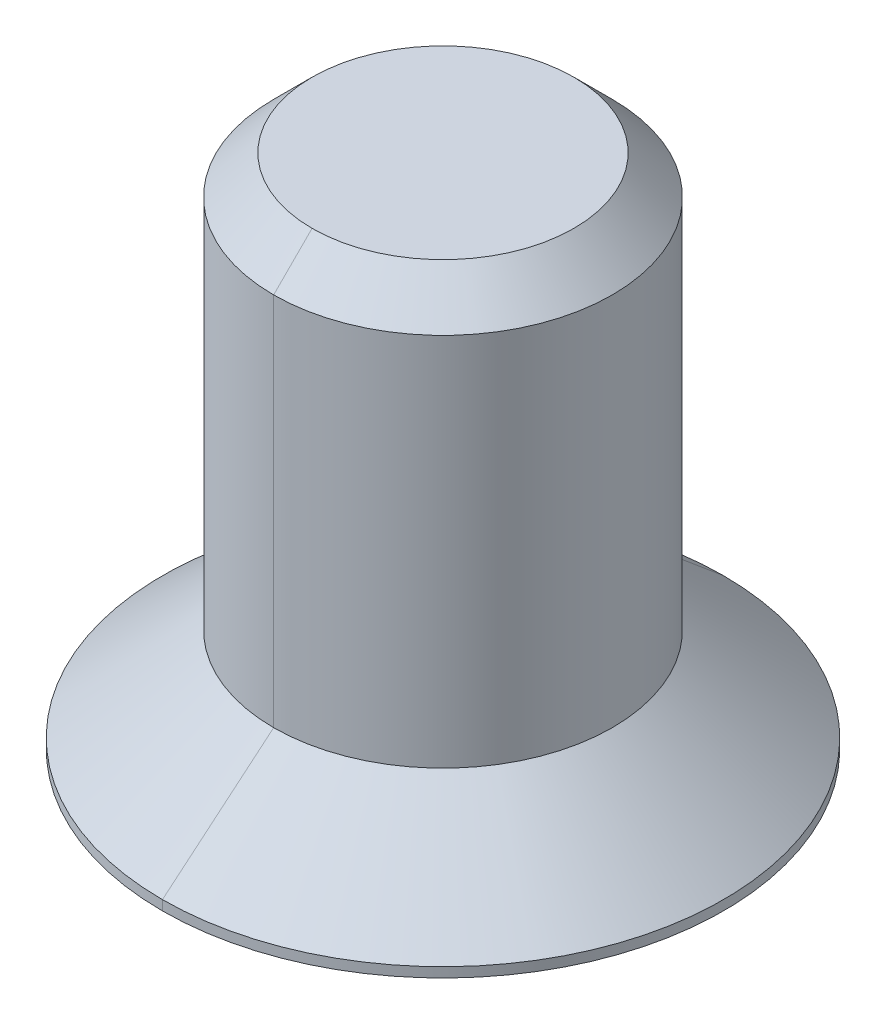
ISO-10303-21;
HEADER;
FILE_DESCRIPTION(('STEP AP214'),'2;1');
FILE_NAME('part.step','',(''),(''),'','','');
FILE_SCHEMA(('AUTOMOTIVE_DESIGN { 1 0 10303 214 1 1 1 1 }'));
ENDSEC;
DATA;
#1=APPLICATION_CONTEXT('core data for automotive mechanical design processes');
#2=APPLICATION_PROTOCOL_DEFINITION('international standard','automotive_design',2000,#1);
#3=PRODUCT_CONTEXT('',#1,'mechanical');
#4=PRODUCT('Part','Part','',(#3));
#5=PRODUCT_RELATED_PRODUCT_CATEGORY('part','',(#4));
#6=PRODUCT_DEFINITION_FORMATION('','',#4);
#7=PRODUCT_DEFINITION_CONTEXT('part definition',#1,'design');
#8=PRODUCT_DEFINITION('design','',#6,#7);
#9=PRODUCT_DEFINITION_SHAPE('','',#8);
#10=(LENGTH_UNIT() NAMED_UNIT(*) SI_UNIT(.MILLI.,.METRE.));
#11=(NAMED_UNIT(*) PLANE_ANGLE_UNIT() SI_UNIT($,.RADIAN.));
#12=(NAMED_UNIT(*) SI_UNIT($,.STERADIAN.) SOLID_ANGLE_UNIT());
#13=UNCERTAINTY_MEASURE_WITH_UNIT(LENGTH_MEASURE(1.E-05),#10,'distance_accuracy_value','');
#14=(GEOMETRIC_REPRESENTATION_CONTEXT(3) GLOBAL_UNCERTAINTY_ASSIGNED_CONTEXT((#13)) GLOBAL_UNIT_ASSIGNED_CONTEXT((#10,
#11,#12)) REPRESENTATION_CONTEXT('',''));
#15=CARTESIAN_POINT('',(0.,0.,0.));
#16=DIRECTION('',(0.,0.,1.));
#17=DIRECTION('',(1.,0.,0.));
#18=AXIS2_PLACEMENT_3D('',#15,#16,#17);
#19=CARTESIAN_POINT('',(0.,-499.649708247747,0.));
#20=DIRECTION('',(0.,-1.,0.));
#21=DIRECTION('',(-1.,0.,0.));
#22=AXIS2_PLACEMENT_3D('',#19,#20,#21);
#23=CONICAL_SURFACE('',#22,866.0254037852,1.0471975512);
#24=DIRECTION('',(0.,-0.499999999997037,-0.86602540378615));
#25=VECTOR('',#24,1.);
#26=CARTESIAN_POINT('',(0.,0.350291748764225,0.));
#27=LINE('',#26,#25);
#28=CARTESIAN_POINT('',(0.,0.350291752253901,0.));
#29=VERTEX_POINT('',#28);
#30=CARTESIAN_POINT('',(0.,-0.337115926284753,-1.19062501870701));
#31=VERTEX_POINT('',#30);
#32=EDGE_CURVE('E11',#29,#31,#27,.T.);
#33=ORIENTED_EDGE('',*,*,#32,.T.);
#34=CARTESIAN_POINT('',(0.,-0.337115923490899,0.));
#35=DIRECTION('',(0.,-1.,0.));
#36=DIRECTION('',(0.,0.,-1.));
#37=AXIS2_PLACEMENT_3D('',#34,#35,#36);
#38=CIRCLE('',#37,1.19062502032);
#39=CARTESIAN_POINT('',(0.595312500000003,-0.337115912,-1.03111149638085));
#40=VERTEX_POINT('',#39);
#41=EDGE_CURVE('E25',#31,#40,#38,.T.);
#42=ORIENTED_EDGE('',*,*,#41,.T.);
#43=CARTESIAN_POINT('',(0.,-0.337115923490899,0.));
#44=DIRECTION('',(0.,-1.,0.));
#45=DIRECTION('',(0.,0.,-1.));
#46=AXIS2_PLACEMENT_3D('',#43,#44,#45);
#47=CIRCLE('',#46,1.19062502032);
#48=CARTESIAN_POINT('',(1.190625,-0.337115912,0.));
#49=VERTEX_POINT('',#48);
#50=EDGE_CURVE('E353',#40,#49,#47,.T.);
#51=ORIENTED_EDGE('',*,*,#50,.T.);
#52=CARTESIAN_POINT('',(0.,-0.337115912,0.));
#53=DIRECTION('',(0.,-1.,0.));
#54=DIRECTION('',(0.,0.,-1.));
#55=AXIS2_PLACEMENT_3D('',#52,#53,#54);
#56=CIRCLE('',#55,1.190625);
#57=CARTESIAN_POINT('',(0.5953125,-0.337115912,1.03111149638085));
#58=VERTEX_POINT('',#57);
#59=EDGE_CURVE('E349',#49,#58,#56,.T.);
#60=ORIENTED_EDGE('',*,*,#59,.T.);
#61=CARTESIAN_POINT('',(0.,-0.337115923490899,0.));
#62=DIRECTION('',(0.,-1.,0.));
#63=DIRECTION('',(0.,0.,-1.));
#64=AXIS2_PLACEMENT_3D('',#61,#62,#63);
#65=CIRCLE('',#64,1.19062502032);
#66=CARTESIAN_POINT('',(0.,-0.337115926284753,1.19062501870701));
#67=VERTEX_POINT('',#66);
#68=EDGE_CURVE('E345',#58,#67,#65,.T.);
#69=ORIENTED_EDGE('',*,*,#68,.T.);
#70=DIRECTION('',(0.,-0.499999999997037,0.86602540378615));
#71=VECTOR('',#70,1.);
#72=CARTESIAN_POINT('',(0.,0.350291748764225,0.));
#73=LINE('',#72,#71);
#74=EDGE_CURVE('E340',#29,#67,#73,.T.);
#75=ORIENTED_EDGE('',*,*,#74,.F.);
#76=EDGE_LOOP('',(#33,#42,#51,#60,#69,#75));
#77=FACE_BOUND('',#76,.T.);
#78=ADVANCED_FACE('F17',(#77),#23,.F.);
#79=CARTESIAN_POINT('',(0.,-499.649708247747,0.));
#80=DIRECTION('',(0.,-1.,0.));
#81=DIRECTION('',(1.,0.,0.));
#82=AXIS2_PLACEMENT_3D('',#79,#80,#81);
#83=CONICAL_SURFACE('',#82,866.0254037852,1.0471975512);
#84=ORIENTED_EDGE('',*,*,#74,.T.);
#85=CARTESIAN_POINT('',(0.,-0.337115923490899,0.));
#86=DIRECTION('',(0.,-1.,0.));
#87=DIRECTION('',(0.,0.,-1.));
#88=AXIS2_PLACEMENT_3D('',#85,#86,#87);
#89=CIRCLE('',#88,1.19062502032);
#90=CARTESIAN_POINT('',(-0.595312500000003,-0.337115912,1.03111149638085));
#91=VERTEX_POINT('',#90);
#92=EDGE_CURVE('E336',#67,#91,#89,.T.);
#93=ORIENTED_EDGE('',*,*,#92,.T.);
#94=CARTESIAN_POINT('',(0.,-0.337115923490899,0.));
#95=DIRECTION('',(0.,-1.,0.));
#96=DIRECTION('',(0.,0.,-1.));
#97=AXIS2_PLACEMENT_3D('',#94,#95,#96);
#98=CIRCLE('',#97,1.19062502032);
#99=CARTESIAN_POINT('',(-1.190625,-0.337115912,0.));
#100=VERTEX_POINT('',#99);
#101=EDGE_CURVE('E332',#91,#100,#98,.T.);
#102=ORIENTED_EDGE('',*,*,#101,.T.);
#103=CARTESIAN_POINT('',(0.,-0.337115923490899,0.));
#104=DIRECTION('',(0.,-1.,0.));
#105=DIRECTION('',(0.,0.,-1.));
#106=AXIS2_PLACEMENT_3D('',#103,#104,#105);
#107=CIRCLE('',#106,1.19062502032);
#108=CARTESIAN_POINT('',(-0.595312500000003,-0.337115923490899,-1.03111149638085));
#109=VERTEX_POINT('',#108);
#110=EDGE_CURVE('E328',#100,#109,#107,.T.);
#111=ORIENTED_EDGE('',*,*,#110,.T.);
#112=CARTESIAN_POINT('',(0.,-0.337115923490899,0.));
#113=DIRECTION('',(0.,-1.,0.));
#114=DIRECTION('',(0.,0.,-1.));
#115=AXIS2_PLACEMENT_3D('',#112,#113,#114);
#116=CIRCLE('',#115,1.19062502032);
#117=EDGE_CURVE('E324',#109,#31,#116,.T.);
#118=ORIENTED_EDGE('',*,*,#117,.T.);
#119=ORIENTED_EDGE('',*,*,#32,.F.);
#120=EDGE_LOOP('',(#84,#93,#102,#111,#118,#119));
#121=FACE_BOUND('',#120,.T.);
#122=ADVANCED_FACE('F381',(#121),#83,.F.);
#123=CARTESIAN_POINT('',(0.,-0.337115923490899,0.));
#124=DIRECTION('',(0.,-1.,0.));
#125=DIRECTION('',(0.,0.,-1.));
#126=AXIS2_PLACEMENT_3D('',#123,#124,#125);
#127=PLANE('',#126);
#128=DIRECTION('',(0.866025403784438,0.,0.500000000000001));
#129=VECTOR('',#128,1.);
#130=CARTESIAN_POINT('',(0.,-0.337115923490899,-1.3748153285078));
#131=LINE('',#130,#129);
#132=CARTESIAN_POINT('',(0.,-0.337115923490899,-1.3748153285078));
#133=VERTEX_POINT('',#132);
#134=EDGE_CURVE('E320',#133,#40,#131,.T.);
#135=ORIENTED_EDGE('',*,*,#134,.T.);
#136=ORIENTED_EDGE('',*,*,#41,.F.);
#137=ORIENTED_EDGE('',*,*,#117,.F.);
#138=DIRECTION('',(0.866025403784438,0.,-0.500000000000001));
#139=VECTOR('',#138,1.);
#140=CARTESIAN_POINT('',(-1.190625,-0.337115923490899,-0.6874076642539));
#141=LINE('',#140,#139);
#142=EDGE_CURVE('E316',#109,#133,#141,.T.);
#143=ORIENTED_EDGE('',*,*,#142,.T.);
#144=EDGE_LOOP('',(#135,#136,#137,#143));
#145=FACE_BOUND('',#144,.T.);
#146=ADVANCED_FACE('F387',(#145),#127,.T.);
#147=CARTESIAN_POINT('',(-1.190625,-0.337115923490899,-0.6874076642539));
#148=DIRECTION('',(-0.500000000000001,0.,-0.866025403784438));
#149=DIRECTION('',(-0.866025403784438,0.,0.500000000000001));
#150=AXIS2_PLACEMENT_3D('',#147,#148,#149);
#151=PLANE('',#150);
#152=DIRECTION('',(0.866025403784438,0.,-0.500000000000001));
#153=VECTOR('',#152,1.);
#154=CARTESIAN_POINT('',(-1.190625,-1.1295959234909,-0.6874076642539));
#155=LINE('',#154,#153);
#156=CARTESIAN_POINT('',(-1.190625,-1.1295959234909,-0.6874076642539));
#157=VERTEX_POINT('',#156);
#158=CARTESIAN_POINT('',(0.,-1.1295959234909,-1.3748153285078));
#159=VERTEX_POINT('',#158);
#160=EDGE_CURVE('E312',#157,#159,#155,.T.);
#161=ORIENTED_EDGE('',*,*,#160,.T.);
#162=DIRECTION('',(0.,-1.,0.));
#163=VECTOR('',#162,1.);
#164=CARTESIAN_POINT('',(0.,-0.337115923490899,-1.3748153285078));
#165=LINE('',#164,#163);
#166=EDGE_CURVE('E307',#133,#159,#165,.T.);
#167=ORIENTED_EDGE('',*,*,#166,.F.);
#168=ORIENTED_EDGE('',*,*,#142,.F.);
#169=DIRECTION('',(0.866025403784438,0.,-0.500000000000001));
#170=VECTOR('',#169,1.);
#171=CARTESIAN_POINT('',(-1.190625,-0.337115923490899,-0.6874076642539));
#172=LINE('',#171,#170);
#173=CARTESIAN_POINT('',(-1.190625,-0.337115923490899,-0.6874076642539));
#174=VERTEX_POINT('',#173);
#175=EDGE_CURVE('E302',#174,#109,#172,.T.);
#176=ORIENTED_EDGE('',*,*,#175,.F.);
#177=DIRECTION('',(0.,-1.,0.));
#178=VECTOR('',#177,1.);
#179=CARTESIAN_POINT('',(-1.190625,-0.337115923490899,-0.6874076642539));
#180=LINE('',#179,#178);
#181=EDGE_CURVE('E298',#174,#157,#180,.T.);
#182=ORIENTED_EDGE('',*,*,#181,.T.);
#183=EDGE_LOOP('',(#161,#167,#168,#176,#182));
#184=FACE_BOUND('',#183,.T.);
#185=ADVANCED_FACE('F414',(#184),#151,.F.);
#186=CARTESIAN_POINT('',(-1.190625,-0.337115923490899,0.6874076642539));
#187=DIRECTION('',(-1.,0.,0.));
#188=DIRECTION('',(0.,0.,1.));
#189=AXIS2_PLACEMENT_3D('',#186,#187,#188);
#190=PLANE('',#189);
#191=DIRECTION('',(0.,0.,-1.));
#192=VECTOR('',#191,1.);
#193=CARTESIAN_POINT('',(-1.190625,-1.1295959234909,0.6874076642539));
#194=LINE('',#193,#192);
#195=CARTESIAN_POINT('',(-1.190625,-1.1295959234909,0.6874076642539));
#196=VERTEX_POINT('',#195);
#197=EDGE_CURVE('E293',#196,#157,#194,.T.);
#198=ORIENTED_EDGE('',*,*,#197,.T.);
#199=ORIENTED_EDGE('',*,*,#181,.F.);
#200=DIRECTION('',(0.,0.,-1.));
#201=VECTOR('',#200,1.);
#202=CARTESIAN_POINT('',(-1.190625,-0.337115923490899,0.6874076642539));
#203=LINE('',#202,#201);
#204=EDGE_CURVE('E288',#100,#174,#203,.T.);
#205=ORIENTED_EDGE('',*,*,#204,.F.);
#206=DIRECTION('',(0.,0.,-1.));
#207=VECTOR('',#206,1.);
#208=CARTESIAN_POINT('',(-1.190625,-0.337115923490899,0.6874076642539));
#209=LINE('',#208,#207);
#210=CARTESIAN_POINT('',(-1.190625,-0.337115923490899,0.6874076642539));
#211=VERTEX_POINT('',#210);
#212=EDGE_CURVE('E283',#211,#100,#209,.T.);
#213=ORIENTED_EDGE('',*,*,#212,.F.);
#214=DIRECTION('',(0.,-1.,0.));
#215=VECTOR('',#214,1.);
#216=CARTESIAN_POINT('',(-1.190625,-0.337115923490899,0.6874076642539));
#217=LINE('',#216,#215);
#218=EDGE_CURVE('E279',#211,#196,#217,.T.);
#219=ORIENTED_EDGE('',*,*,#218,.T.);
#220=EDGE_LOOP('',(#198,#199,#205,#213,#219));
#221=FACE_BOUND('',#220,.T.);
#222=ADVANCED_FACE('F410',(#221),#190,.F.);
#223=CARTESIAN_POINT('',(0.,-0.337115923490899,1.3748153285078));
#224=DIRECTION('',(-0.500000000000001,0.,0.866025403784438));
#225=DIRECTION('',(0.866025403784438,0.,0.500000000000001));
#226=AXIS2_PLACEMENT_3D('',#223,#224,#225);
#227=PLANE('',#226);
#228=DIRECTION('',(-0.866025403784438,0.,-0.500000000000001));
#229=VECTOR('',#228,1.);
#230=CARTESIAN_POINT('',(0.,-1.1295959234909,1.3748153285078));
#231=LINE('',#230,#229);
#232=CARTESIAN_POINT('',(0.,-1.1295959234909,1.3748153285078));
#233=VERTEX_POINT('',#232);
#234=EDGE_CURVE('E274',#233,#196,#231,.T.);
#235=ORIENTED_EDGE('',*,*,#234,.T.);
#236=ORIENTED_EDGE('',*,*,#218,.F.);
#237=DIRECTION('',(-0.866025403784438,0.,-0.500000000000001));
#238=VECTOR('',#237,1.);
#239=CARTESIAN_POINT('',(0.,-0.337115923490899,1.3748153285078));
#240=LINE('',#239,#238);
#241=EDGE_CURVE('E269',#91,#211,#240,.T.);
#242=ORIENTED_EDGE('',*,*,#241,.F.);
#243=DIRECTION('',(-0.866025403784438,0.,-0.500000000000001));
#244=VECTOR('',#243,1.);
#245=CARTESIAN_POINT('',(0.,-0.337115923490899,1.3748153285078));
#246=LINE('',#245,#244);
#247=CARTESIAN_POINT('',(0.,-0.337115923490899,1.3748153285078));
#248=VERTEX_POINT('',#247);
#249=EDGE_CURVE('E264',#248,#91,#246,.T.);
#250=ORIENTED_EDGE('',*,*,#249,.F.);
#251=DIRECTION('',(0.,-1.,0.));
#252=VECTOR('',#251,1.);
#253=CARTESIAN_POINT('',(0.,-0.337115923490899,1.3748153285078));
#254=LINE('',#253,#252);
#255=EDGE_CURVE('E260',#248,#233,#254,.T.);
#256=ORIENTED_EDGE('',*,*,#255,.T.);
#257=EDGE_LOOP('',(#235,#236,#242,#250,#256));
#258=FACE_BOUND('',#257,.T.);
#259=ADVANCED_FACE('F402',(#258),#227,.F.);
#260=CARTESIAN_POINT('',(1.190625,-0.337115923490899,0.6874076642539));
#261=DIRECTION('',(0.500000000000001,0.,0.866025403784438));
#262=DIRECTION('',(0.866025403784438,0.,-0.500000000000001));
#263=AXIS2_PLACEMENT_3D('',#260,#261,#262);
#264=PLANE('',#263);
#265=DIRECTION('',(-0.866025403784438,0.,0.500000000000001));
#266=VECTOR('',#265,1.);
#267=CARTESIAN_POINT('',(1.190625,-1.1295959234909,0.6874076642539));
#268=LINE('',#267,#266);
#269=CARTESIAN_POINT('',(1.190625,-1.1295959234909,0.6874076642539));
#270=VERTEX_POINT('',#269);
#271=EDGE_CURVE('E255',#270,#233,#268,.T.);
#272=ORIENTED_EDGE('',*,*,#271,.T.);
#273=ORIENTED_EDGE('',*,*,#255,.F.);
#274=DIRECTION('',(-0.866025403784438,0.,0.500000000000001));
#275=VECTOR('',#274,1.);
#276=CARTESIAN_POINT('',(1.190625,-0.337115923490899,0.6874076642539));
#277=LINE('',#276,#275);
#278=EDGE_CURVE('E250',#58,#248,#277,.T.);
#279=ORIENTED_EDGE('',*,*,#278,.F.);
#280=DIRECTION('',(-0.866025403784438,0.,0.500000000000001));
#281=VECTOR('',#280,1.);
#282=CARTESIAN_POINT('',(1.190625,-0.337115923490899,0.6874076642539));
#283=LINE('',#282,#281);
#284=CARTESIAN_POINT('',(1.190625,-0.337115923490899,0.6874076642539));
#285=VERTEX_POINT('',#284);
#286=EDGE_CURVE('E245',#285,#58,#283,.T.);
#287=ORIENTED_EDGE('',*,*,#286,.F.);
#288=DIRECTION('',(0.,-1.,0.));
#289=VECTOR('',#288,1.);
#290=CARTESIAN_POINT('',(1.190625,-0.337115923490899,0.6874076642539));
#291=LINE('',#290,#289);
#292=EDGE_CURVE('E241',#285,#270,#291,.T.);
#293=ORIENTED_EDGE('',*,*,#292,.T.);
#294=EDGE_LOOP('',(#272,#273,#279,#287,#293));
#295=FACE_BOUND('',#294,.T.);
#296=ADVANCED_FACE('F400',(#295),#264,.F.);
#297=CARTESIAN_POINT('',(1.190625,-0.337115923490899,-0.6874076642539));
#298=DIRECTION('',(1.,0.,0.));
#299=DIRECTION('',(0.,0.,-1.));
#300=AXIS2_PLACEMENT_3D('',#297,#298,#299);
#301=PLANE('',#300);
#302=DIRECTION('',(0.,-1.,0.));
#303=VECTOR('',#302,1.);
#304=CARTESIAN_POINT('',(1.190625,-0.337115923490899,-0.6874076642539));
#305=LINE('',#304,#303);
#306=CARTESIAN_POINT('',(1.190625,-0.337115923490899,-0.6874076642539));
#307=VERTEX_POINT('',#306);
#308=CARTESIAN_POINT('',(1.190625,-1.1295959234909,-0.6874076642539));
#309=VERTEX_POINT('',#308);
#310=EDGE_CURVE('E237',#307,#309,#305,.T.);
#311=ORIENTED_EDGE('',*,*,#310,.T.);
#312=DIRECTION('',(0.,0.,-1.));
#313=VECTOR('',#312,1.);
#314=CARTESIAN_POINT('',(1.190625,-1.1295959234909,0.));
#315=LINE('',#314,#313);
#316=EDGE_CURVE('E232',#270,#309,#315,.T.);
#317=ORIENTED_EDGE('',*,*,#316,.F.);
#318=ORIENTED_EDGE('',*,*,#292,.F.);
#319=DIRECTION('',(0.,0.,1.));
#320=VECTOR('',#319,1.);
#321=CARTESIAN_POINT('',(1.190625,-0.337115923490899,-0.6874076642539));
#322=LINE('',#321,#320);
#323=EDGE_CURVE('E227',#49,#285,#322,.T.);
#324=ORIENTED_EDGE('',*,*,#323,.F.);
#325=DIRECTION('',(0.,0.,1.));
#326=VECTOR('',#325,1.);
#327=CARTESIAN_POINT('',(1.190625,-0.337115923490899,-0.6874076642539));
#328=LINE('',#327,#326);
#329=EDGE_CURVE('E222',#307,#49,#328,.T.);
#330=ORIENTED_EDGE('',*,*,#329,.F.);
#331=EDGE_LOOP('',(#311,#317,#318,#324,#330));
#332=FACE_BOUND('',#331,.T.);
#333=ADVANCED_FACE('F369',(#332),#301,.F.);
#334=CARTESIAN_POINT('',(0.,-0.337115923490899,0.));
#335=DIRECTION('',(0.,-1.,0.));
#336=DIRECTION('',(0.,0.,-1.));
#337=AXIS2_PLACEMENT_3D('',#334,#335,#336);
#338=PLANE('',#337);
#339=ORIENTED_EDGE('',*,*,#329,.T.);
#340=ORIENTED_EDGE('',*,*,#50,.F.);
#341=DIRECTION('',(0.866025403784438,0.,0.500000000000001));
#342=VECTOR('',#341,1.);
#343=CARTESIAN_POINT('',(0.,-0.337115923490899,-1.3748153285078));
#344=LINE('',#343,#342);
#345=EDGE_CURVE('E217',#40,#307,#344,.T.);
#346=ORIENTED_EDGE('',*,*,#345,.T.);
#347=EDGE_LOOP('',(#339,#340,#346));
#348=FACE_BOUND('',#347,.T.);
#349=ADVANCED_FACE('F372',(#348),#338,.T.);
#350=CARTESIAN_POINT('',(0.,-0.337115923490899,-1.3748153285078));
#351=DIRECTION('',(0.500000000000001,0.,-0.866025403784438));
#352=DIRECTION('',(-0.866025403784438,0.,-0.500000000000001));
#353=AXIS2_PLACEMENT_3D('',#350,#351,#352);
#354=PLANE('',#353);
#355=DIRECTION('',(0.866025403784438,0.,0.500000000000001));
#356=VECTOR('',#355,1.);
#357=CARTESIAN_POINT('',(0.,-1.1295959234909,-1.3748153285078));
#358=LINE('',#357,#356);
#359=EDGE_CURVE('E212',#159,#309,#358,.T.);
#360=ORIENTED_EDGE('',*,*,#359,.T.);
#361=ORIENTED_EDGE('',*,*,#310,.F.);
#362=ORIENTED_EDGE('',*,*,#345,.F.);
#363=ORIENTED_EDGE('',*,*,#134,.F.);
#364=ORIENTED_EDGE('',*,*,#166,.T.);
#365=EDGE_LOOP('',(#360,#361,#362,#363,#364));
#366=FACE_BOUND('',#365,.T.);
#367=ADVANCED_FACE('F391',(#366),#354,.F.);
#368=CARTESIAN_POINT('',(3.450336,-1.1295959234909,0.));
#369=DIRECTION('',(0.,1.,0.));
#370=DIRECTION('',(0.,0.,1.));
#371=AXIS2_PLACEMENT_3D('',#368,#369,#370);
#372=PLANE('',#371);
#373=ORIENTED_EDGE('',*,*,#316,.T.);
#374=ORIENTED_EDGE('',*,*,#359,.F.);
#375=ORIENTED_EDGE('',*,*,#160,.F.);
#376=ORIENTED_EDGE('',*,*,#197,.F.);
#377=ORIENTED_EDGE('',*,*,#234,.F.);
#378=ORIENTED_EDGE('',*,*,#271,.F.);
#379=EDGE_LOOP('',(#373,#374,#375,#376,#377,#378));
#380=FACE_BOUND('',#379,.T.);
#381=CARTESIAN_POINT('',(0.,-1.1295959234909,0.));
#382=DIRECTION('',(0.,-1.,0.));
#383=DIRECTION('',(0.,0.,-1.));
#384=AXIS2_PLACEMENT_3D('',#381,#382,#383);
#385=CIRCLE('',#384,3.450336);
#386=CARTESIAN_POINT('',(0.,-1.1295959234909,-3.450336));
#387=VERTEX_POINT('',#386);
#388=CARTESIAN_POINT('',(0.,-1.1295959234909,3.450336));
#389=VERTEX_POINT('',#388);
#390=EDGE_CURVE('E208',#387,#389,#385,.T.);
#391=ORIENTED_EDGE('',*,*,#390,.T.);
#392=CARTESIAN_POINT('',(0.,-1.1295959234909,0.));
#393=DIRECTION('',(0.,-1.,0.));
#394=DIRECTION('',(0.,0.,-1.));
#395=AXIS2_PLACEMENT_3D('',#392,#393,#394);
#396=CIRCLE('',#395,3.450336);
#397=EDGE_CURVE('E204',#389,#387,#396,.T.);
#398=ORIENTED_EDGE('',*,*,#397,.T.);
#399=EDGE_LOOP('',(#391,#398));
#400=FACE_BOUND('',#399,.T.);
#401=ADVANCED_FACE('F396',(#380,#400),#372,.F.);
#402=CARTESIAN_POINT('',(0.,-1.1295959234909,0.));
#403=DIRECTION('',(0.,1.,0.));
#404=DIRECTION('',(1.,0.,0.));
#405=AXIS2_PLACEMENT_3D('',#402,#403,#404);
#406=CYLINDRICAL_SURFACE('',#405,3.450336);
#407=CARTESIAN_POINT('',(0.,-1.0089636041143,0.));
#408=DIRECTION('',(0.,-1.,0.));
#409=DIRECTION('',(0.,0.,-1.));
#410=AXIS2_PLACEMENT_3D('',#407,#408,#409);
#411=CIRCLE('',#410,3.450336);
#412=CARTESIAN_POINT('',(0.,-1.0089636041143,3.450336));
#413=VERTEX_POINT('',#412);
#414=CARTESIAN_POINT('',(0.,-1.0089636041143,-3.450336));
#415=VERTEX_POINT('',#414);
#416=EDGE_CURVE('E200',#413,#415,#411,.T.);
#417=ORIENTED_EDGE('',*,*,#416,.T.);
#418=DIRECTION('',(0.,1.,0.));
#419=VECTOR('',#418,1.);
#420=CARTESIAN_POINT('',(0.,-1.1295959234909,-3.450336));
#421=LINE('',#420,#419);
#422=EDGE_CURVE('E195',#387,#415,#421,.T.);
#423=ORIENTED_EDGE('',*,*,#422,.F.);
#424=ORIENTED_EDGE('',*,*,#397,.F.);
#425=DIRECTION('',(0.,1.,0.));
#426=VECTOR('',#425,1.);
#427=CARTESIAN_POINT('',(0.,-1.1295959234909,3.450336));
#428=LINE('',#427,#426);
#429=EDGE_CURVE('E191',#389,#413,#428,.T.);
#430=ORIENTED_EDGE('',*,*,#429,.T.);
#431=EDGE_LOOP('',(#417,#423,#424,#430));
#432=FACE_BOUND('',#431,.T.);
#433=ADVANCED_FACE('F498',(#432),#406,.T.);
#434=CARTESIAN_POINT('',(0.,-1.1295959234909,0.));
#435=DIRECTION('',(0.,1.,0.));
#436=DIRECTION('',(-1.,0.,0.));
#437=AXIS2_PLACEMENT_3D('',#434,#435,#436);
#438=CYLINDRICAL_SURFACE('',#437,3.450336);
#439=ORIENTED_EDGE('',*,*,#390,.F.);
#440=ORIENTED_EDGE('',*,*,#422,.T.);
#441=CARTESIAN_POINT('',(0.,-1.0089636041143,0.));
#442=DIRECTION('',(0.,-1.,0.));
#443=DIRECTION('',(0.,0.,-1.));
#444=AXIS2_PLACEMENT_3D('',#441,#442,#443);
#445=CIRCLE('',#444,3.450336);
#446=EDGE_CURVE('E186',#415,#413,#445,.T.);
#447=ORIENTED_EDGE('',*,*,#446,.T.);
#448=ORIENTED_EDGE('',*,*,#429,.F.);
#449=EDGE_LOOP('',(#439,#440,#447,#448));
#450=FACE_BOUND('',#449,.T.);
#451=ADVANCED_FACE('F507',(#450),#438,.T.);
#452=CARTESIAN_POINT('',(0.,0.13853534910737,0.));
#453=DIRECTION('',(0.,-1.,0.));
#454=DIRECTION('',(-1.,0.,0.));
#455=AXIS2_PLACEMENT_3D('',#452,#453,#454);
#456=CONICAL_SURFACE('',#455,2.0828,0.872664626);
#457=ORIENTED_EDGE('',*,*,#446,.F.);
#458=DIRECTION('',(0.,-0.642787609684367,-0.766044443120801));
#459=VECTOR('',#458,1.);
#460=CARTESIAN_POINT('',(0.,0.13853534910737,-2.0828));
#461=LINE('',#460,#459);
#462=CARTESIAN_POINT('',(0.,0.13853534910737,-2.0828));
#463=VERTEX_POINT('',#462);
#464=EDGE_CURVE('E181',#463,#415,#461,.T.);
#465=ORIENTED_EDGE('',*,*,#464,.F.);
#466=CARTESIAN_POINT('',(0.,0.13853534910737,0.));
#467=DIRECTION('',(0.,-1.,0.));
#468=DIRECTION('',(0.,0.,-1.));
#469=AXIS2_PLACEMENT_3D('',#466,#467,#468);
#470=CIRCLE('',#469,2.0828);
#471=CARTESIAN_POINT('',(0.,0.13853534910737,2.0828));
#472=VERTEX_POINT('',#471);
#473=EDGE_CURVE('E177',#463,#472,#470,.T.);
#474=ORIENTED_EDGE('',*,*,#473,.T.);
#475=DIRECTION('',(0.,-0.642787609684367,0.766044443120801));
#476=VECTOR('',#475,1.);
#477=CARTESIAN_POINT('',(0.,0.13853534910737,2.0828));
#478=LINE('',#477,#476);
#479=EDGE_CURVE('E172',#472,#413,#478,.T.);
#480=ORIENTED_EDGE('',*,*,#479,.T.);
#481=EDGE_LOOP('',(#457,#465,#474,#480));
#482=FACE_BOUND('',#481,.T.);
#483=ADVANCED_FACE('F517',(#482),#456,.T.);
#484=CARTESIAN_POINT('',(0.,0.13853534910737,0.));
#485=DIRECTION('',(0.,-1.,0.));
#486=DIRECTION('',(1.,0.,0.));
#487=AXIS2_PLACEMENT_3D('',#484,#485,#486);
#488=CONICAL_SURFACE('',#487,2.0828,0.872664626);
#489=CARTESIAN_POINT('',(0.,0.13853534910737,0.));
#490=DIRECTION('',(0.,-1.,0.));
#491=DIRECTION('',(0.,0.,-1.));
#492=AXIS2_PLACEMENT_3D('',#489,#490,#491);
#493=CIRCLE('',#492,2.0828);
#494=EDGE_CURVE('E167',#472,#463,#493,.T.);
#495=ORIENTED_EDGE('',*,*,#494,.T.);
#496=ORIENTED_EDGE('',*,*,#464,.T.);
#497=ORIENTED_EDGE('',*,*,#416,.F.);
#498=ORIENTED_EDGE('',*,*,#479,.F.);
#499=EDGE_LOOP('',(#495,#496,#497,#498));
#500=FACE_BOUND('',#499,.T.);
#501=ADVANCED_FACE('F527',(#500),#488,.T.);
#502=CARTESIAN_POINT('',(0.,-1.1295959234909,0.));
#503=DIRECTION('',(0.,1.,0.));
#504=DIRECTION('',(1.,0.,0.));
#505=AXIS2_PLACEMENT_3D('',#502,#503,#504);
#506=CYLINDRICAL_SURFACE('',#505,2.0828);
#507=CARTESIAN_POINT('',(0.,4.74796407650909,0.));
#508=DIRECTION('',(0.,-1.,0.));
#509=DIRECTION('',(0.,0.,-1.));
#510=AXIS2_PLACEMENT_3D('',#507,#508,#509);
#511=CIRCLE('',#510,2.0828);
#512=CARTESIAN_POINT('',(0.,4.74796407650909,2.0828));
#513=VERTEX_POINT('',#512);
#514=CARTESIAN_POINT('',(0.,4.74796407650909,-2.0828));
#515=VERTEX_POINT('',#514);
#516=EDGE_CURVE('E138',#513,#515,#511,.T.);
#517=ORIENTED_EDGE('',*,*,#516,.T.);
#518=DIRECTION('',(0.,1.,0.));
#519=VECTOR('',#518,1.);
#520=CARTESIAN_POINT('',(0.,0.138535349107371,-2.0828));
#521=LINE('',#520,#519);
#522=EDGE_CURVE('E159',#463,#515,#521,.T.);
#523=ORIENTED_EDGE('',*,*,#522,.F.);
#524=ORIENTED_EDGE('',*,*,#494,.F.);
#525=DIRECTION('',(0.,1.,0.));
#526=VECTOR('',#525,1.);
#527=CARTESIAN_POINT('',(0.,0.138535349107371,2.0828));
#528=LINE('',#527,#526);
#529=EDGE_CURVE('E155',#472,#513,#528,.T.);
#530=ORIENTED_EDGE('',*,*,#529,.T.);
#531=EDGE_LOOP('',(#517,#523,#524,#530));
#532=FACE_BOUND('',#531,.T.);
#533=ADVANCED_FACE('F537',(#532),#506,.T.);
#534=CARTESIAN_POINT('',(0.,-1.1295959234909,0.));
#535=DIRECTION('',(0.,1.,0.));
#536=DIRECTION('',(-1.,0.,0.));
#537=AXIS2_PLACEMENT_3D('',#534,#535,#536);
#538=CYLINDRICAL_SURFACE('',#537,2.0828);
#539=ORIENTED_EDGE('',*,*,#473,.F.);
#540=ORIENTED_EDGE('',*,*,#522,.T.);
#541=CARTESIAN_POINT('',(0.,4.74796407650909,0.));
#542=DIRECTION('',(0.,-1.,0.));
#543=DIRECTION('',(0.,0.,-1.));
#544=AXIS2_PLACEMENT_3D('',#541,#542,#543);
#545=CIRCLE('',#544,2.0828);
#546=EDGE_CURVE('E150',#515,#513,#545,.T.);
#547=ORIENTED_EDGE('',*,*,#546,.T.);
#548=ORIENTED_EDGE('',*,*,#529,.F.);
#549=EDGE_LOOP('',(#539,#540,#547,#548));
#550=FACE_BOUND('',#549,.T.);
#551=ADVANCED_FACE('F547',(#550),#538,.T.);
#552=CARTESIAN_POINT('',(0.,5.22040407650909,0.));
#553=DIRECTION('',(0.,-1.,0.));
#554=DIRECTION('',(-1.,0.,0.));
#555=AXIS2_PLACEMENT_3D('',#552,#553,#554);
#556=CONICAL_SURFACE('',#555,1.61036,0.7853981634);
#557=ORIENTED_EDGE('',*,*,#546,.F.);
#558=DIRECTION('',(0.,-0.707106781184742,-0.707106781188353));
#559=VECTOR('',#558,1.);
#560=CARTESIAN_POINT('',(0.,5.22040407650909,-1.61036));
#561=LINE('',#560,#559);
#562=CARTESIAN_POINT('',(0.,5.22040407650909,-1.61036));
#563=VERTEX_POINT('',#562);
#564=EDGE_CURVE('E130',#563,#515,#561,.T.);
#565=ORIENTED_EDGE('',*,*,#564,.F.);
#566=CARTESIAN_POINT('',(0.,5.22040407650909,0.));
#567=DIRECTION('',(0.,-1.,0.));
#568=DIRECTION('',(0.,0.,-1.));
#569=AXIS2_PLACEMENT_3D('',#566,#567,#568);
#570=CIRCLE('',#569,1.61036);
#571=CARTESIAN_POINT('',(0.,5.22040407650909,1.61036));
#572=VERTEX_POINT('',#571);
#573=EDGE_CURVE('E123',#563,#572,#570,.T.);
#574=ORIENTED_EDGE('',*,*,#573,.T.);
#575=DIRECTION('',(0.,-0.707106781184742,0.707106781188353));
#576=VECTOR('',#575,1.);
#577=CARTESIAN_POINT('',(0.,5.22040407650909,1.61036));
#578=LINE('',#577,#576);
#579=EDGE_CURVE('E127',#572,#513,#578,.T.);
#580=ORIENTED_EDGE('',*,*,#579,.T.);
#581=EDGE_LOOP('',(#557,#565,#574,#580));
#582=FACE_BOUND('',#581,.T.);
#583=ADVANCED_FACE('F126',(#582),#556,.T.);
#584=CARTESIAN_POINT('',(0.,5.22040407650909,0.));
#585=DIRECTION('',(0.,-1.,0.));
#586=DIRECTION('',(1.,0.,0.));
#587=AXIS2_PLACEMENT_3D('',#584,#585,#586);
#588=CONICAL_SURFACE('',#587,1.61036,0.7853981634);
#589=CARTESIAN_POINT('',(0.,5.22040407650909,0.));
#590=DIRECTION('',(0.,-1.,0.));
#591=DIRECTION('',(0.,0.,-1.));
#592=AXIS2_PLACEMENT_3D('',#589,#590,#591);
#593=CIRCLE('',#592,1.61036);
#594=EDGE_CURVE('E137',#572,#563,#593,.T.);
#595=ORIENTED_EDGE('',*,*,#594,.T.);
#596=ORIENTED_EDGE('',*,*,#564,.T.);
#597=ORIENTED_EDGE('',*,*,#516,.F.);
#598=ORIENTED_EDGE('',*,*,#579,.F.);
#599=EDGE_LOOP('',(#595,#596,#597,#598));
#600=FACE_BOUND('',#599,.T.);
#601=ADVANCED_FACE('F136',(#600),#588,.T.);
#602=CARTESIAN_POINT('',(0.,5.22040407650909,0.));
#603=DIRECTION('',(0.,-1.,0.));
#604=DIRECTION('',(0.,0.,-1.));
#605=AXIS2_PLACEMENT_3D('',#602,#603,#604);
#606=PLANE('',#605);
#607=ORIENTED_EDGE('',*,*,#573,.F.);
#608=ORIENTED_EDGE('',*,*,#594,.F.);
#609=EDGE_LOOP('',(#607,#608));
#610=FACE_BOUND('',#609,.T.);
#611=ADVANCED_FACE('F140',(#610),#606,.F.);
#612=CARTESIAN_POINT('',(0.,-0.337115923490899,0.));
#613=DIRECTION('',(0.,-1.,0.));
#614=DIRECTION('',(0.,0.,-1.));
#615=AXIS2_PLACEMENT_3D('',#612,#613,#614);
#616=PLANE('',#615);
#617=ORIENTED_EDGE('',*,*,#286,.T.);
#618=ORIENTED_EDGE('',*,*,#59,.F.);
#619=ORIENTED_EDGE('',*,*,#323,.T.);
#620=EDGE_LOOP('',(#617,#618,#619));
#621=FACE_BOUND('',#620,.T.);
#622=ADVANCED_FACE('F374',(#621),#616,.T.);
#623=CARTESIAN_POINT('',(0.,-0.337115923490899,0.));
#624=DIRECTION('',(0.,-1.,0.));
#625=DIRECTION('',(0.,0.,-1.));
#626=AXIS2_PLACEMENT_3D('',#623,#624,#625);
#627=PLANE('',#626);
#628=ORIENTED_EDGE('',*,*,#249,.T.);
#629=ORIENTED_EDGE('',*,*,#92,.F.);
#630=ORIENTED_EDGE('',*,*,#68,.F.);
#631=ORIENTED_EDGE('',*,*,#278,.T.);
#632=EDGE_LOOP('',(#628,#629,#630,#631));
#633=FACE_BOUND('',#632,.T.);
#634=ADVANCED_FACE('F379',(#633),#627,.T.);
#635=CARTESIAN_POINT('',(0.,-0.337115923490899,0.));
#636=DIRECTION('',(0.,-1.,0.));
#637=DIRECTION('',(0.,0.,-1.));
#638=AXIS2_PLACEMENT_3D('',#635,#636,#637);
#639=PLANE('',#638);
#640=ORIENTED_EDGE('',*,*,#212,.T.);
#641=ORIENTED_EDGE('',*,*,#101,.F.);
#642=ORIENTED_EDGE('',*,*,#241,.T.);
#643=EDGE_LOOP('',(#640,#641,#642));
#644=FACE_BOUND('',#643,.T.);
#645=ADVANCED_FACE('F406',(#644),#639,.T.);
#646=CARTESIAN_POINT('',(0.,-0.337115923490899,0.));
#647=DIRECTION('',(0.,-1.,0.));
#648=DIRECTION('',(0.,0.,-1.));
#649=AXIS2_PLACEMENT_3D('',#646,#647,#648);
#650=PLANE('',#649);
#651=ORIENTED_EDGE('',*,*,#175,.T.);
#652=ORIENTED_EDGE('',*,*,#110,.F.);
#653=ORIENTED_EDGE('',*,*,#204,.T.);
#654=EDGE_LOOP('',(#651,#652,#653));
#655=FACE_BOUND('',#654,.T.);
#656=ADVANCED_FACE('F412',(#655),#650,.T.);
#657=CLOSED_SHELL('',(#78,#122,#146,#185,#222,#259,#296,#333,#349,#367,#401,#433,#451,#483,#501,
#533,#551,#583,#601,#611,#622,#634,#645,#656));
#658=MANIFOLD_SOLID_BREP('B1',#657);
#659=ADVANCED_BREP_SHAPE_REPRESENTATION('',(#18,#658),#14);
#660=SHAPE_DEFINITION_REPRESENTATION(#9,#659);
ENDSEC;
END-ISO-10303-21;
